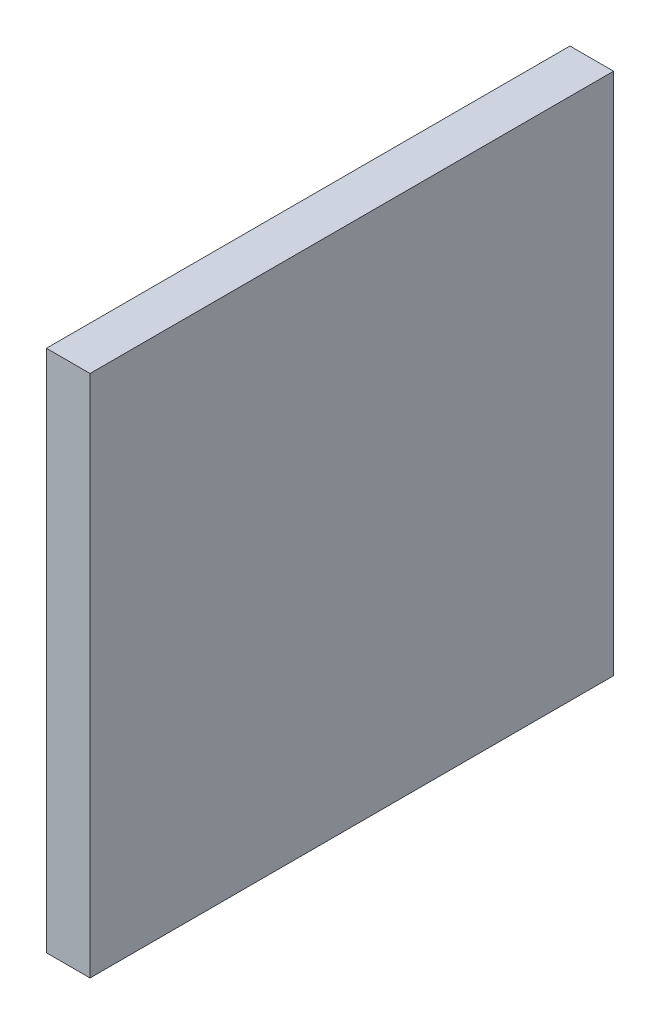
ISO-10303-21;
HEADER;
FILE_DESCRIPTION(('STEP AP214'),'2;1');
FILE_NAME('part.step','',(''),(''),'','','');
FILE_SCHEMA(('AUTOMOTIVE_DESIGN { 1 0 10303 214 1 1 1 1 }'));
ENDSEC;
DATA;
#1=APPLICATION_CONTEXT('core data for automotive mechanical design processes');
#2=APPLICATION_PROTOCOL_DEFINITION('international standard','automotive_design',2000,#1);
#3=PRODUCT_CONTEXT('',#1,'mechanical');
#4=PRODUCT('Part','Part','',(#3));
#5=PRODUCT_RELATED_PRODUCT_CATEGORY('part','',(#4));
#6=PRODUCT_DEFINITION_FORMATION('','',#4);
#7=PRODUCT_DEFINITION_CONTEXT('part definition',#1,'design');
#8=PRODUCT_DEFINITION('design','',#6,#7);
#9=PRODUCT_DEFINITION_SHAPE('','',#8);
#10=(LENGTH_UNIT() NAMED_UNIT(*) SI_UNIT(.MILLI.,.METRE.));
#11=(NAMED_UNIT(*) PLANE_ANGLE_UNIT() SI_UNIT($,.RADIAN.));
#12=(NAMED_UNIT(*) SI_UNIT($,.STERADIAN.) SOLID_ANGLE_UNIT());
#13=UNCERTAINTY_MEASURE_WITH_UNIT(LENGTH_MEASURE(1.E-05),#10,'distance_accuracy_value','');
#14=(GEOMETRIC_REPRESENTATION_CONTEXT(3) GLOBAL_UNCERTAINTY_ASSIGNED_CONTEXT((#13)) GLOBAL_UNIT_ASSIGNED_CONTEXT((#10,
#11,#12)) REPRESENTATION_CONTEXT('',''));
#15=CARTESIAN_POINT('',(0.,0.,0.));
#16=DIRECTION('',(0.,0.,1.));
#17=DIRECTION('',(1.,0.,0.));
#18=AXIS2_PLACEMENT_3D('',#15,#16,#17);
#19=CARTESIAN_POINT('',(0.,-457.2,190.5));
#20=DIRECTION('',(-1.,0.,0.));
#21=DIRECTION('',(0.,0.,1.));
#22=AXIS2_PLACEMENT_3D('',#19,#20,#21);
#23=PLANE('',#22);
#24=DIRECTION('',(0.,0.,1.));
#25=VECTOR('',#24,1.);
#26=CARTESIAN_POINT('',(0.,0.,190.5));
#27=LINE('',#26,#25);
#28=CARTESIAN_POINT('',(0.,0.,0.));
#29=VERTEX_POINT('',#28);
#30=CARTESIAN_POINT('',(0.,0.,457.2));
#31=VERTEX_POINT('',#30);
#32=EDGE_CURVE('E103',#29,#31,#27,.T.);
#33=ORIENTED_EDGE('',*,*,#32,.F.);
#34=DIRECTION('',(0.,1.,0.));
#35=VECTOR('',#34,1.);
#36=CARTESIAN_POINT('',(0.,-457.2,0.));
#37=LINE('',#36,#35);
#38=CARTESIAN_POINT('',(0.,-457.2,0.));
#39=VERTEX_POINT('',#38);
#40=EDGE_CURVE('E11',#39,#29,#37,.T.);
#41=ORIENTED_EDGE('',*,*,#40,.F.);
#42=DIRECTION('',(0.,0.,1.));
#43=VECTOR('',#42,1.);
#44=CARTESIAN_POINT('',(0.,-457.2,190.5));
#45=LINE('',#44,#43);
#46=CARTESIAN_POINT('',(0.,-457.2,457.2));
#47=VERTEX_POINT('',#46);
#48=EDGE_CURVE('E81',#39,#47,#45,.T.);
#49=ORIENTED_EDGE('',*,*,#48,.T.);
#50=DIRECTION('',(0.,1.,0.));
#51=VECTOR('',#50,1.);
#52=CARTESIAN_POINT('',(0.,-457.2,457.2));
#53=LINE('',#52,#51);
#54=EDGE_CURVE('E40',#47,#31,#53,.T.);
#55=ORIENTED_EDGE('',*,*,#54,.T.);
#56=EDGE_LOOP('',(#33,#41,#49,#55));
#57=FACE_BOUND('',#56,.T.);
#58=ADVANCED_FACE('F18',(#57),#23,.T.);
#59=CARTESIAN_POINT('',(51.7014593019343,-457.2,0.));
#60=DIRECTION('',(0.,0.,1.));
#61=DIRECTION('',(1.,0.,0.));
#62=AXIS2_PLACEMENT_3D('',#59,#60,#61);
#63=PLANE('',#62);
#64=DIRECTION('',(1.,0.,0.));
#65=VECTOR('',#64,1.);
#66=CARTESIAN_POINT('',(51.7014593019343,0.,0.));
#67=LINE('',#66,#65);
#68=CARTESIAN_POINT('',(38.1,0.,0.));
#69=VERTEX_POINT('',#68);
#70=EDGE_CURVE('E88',#29,#69,#67,.T.);
#71=ORIENTED_EDGE('',*,*,#70,.T.);
#72=DIRECTION('',(0.,1.,0.));
#73=VECTOR('',#72,1.);
#74=CARTESIAN_POINT('',(38.1,-457.2,0.));
#75=LINE('',#74,#73);
#76=CARTESIAN_POINT('',(38.1,-457.2,0.));
#77=VERTEX_POINT('',#76);
#78=EDGE_CURVE('E27',#77,#69,#75,.T.);
#79=ORIENTED_EDGE('',*,*,#78,.F.);
#80=DIRECTION('',(1.,0.,0.));
#81=VECTOR('',#80,1.);
#82=CARTESIAN_POINT('',(51.7014593019343,-457.2,0.));
#83=LINE('',#82,#81);
#84=EDGE_CURVE('E75',#39,#77,#83,.T.);
#85=ORIENTED_EDGE('',*,*,#84,.F.);
#86=ORIENTED_EDGE('',*,*,#40,.T.);
#87=EDGE_LOOP('',(#71,#79,#85,#86));
#88=FACE_BOUND('',#87,.T.);
#89=ADVANCED_FACE('F86',(#88),#63,.F.);
#90=CARTESIAN_POINT('',(38.1,-457.2,190.5));
#91=DIRECTION('',(-1.,0.,0.));
#92=DIRECTION('',(0.,0.,1.));
#93=AXIS2_PLACEMENT_3D('',#90,#91,#92);
#94=PLANE('',#93);
#95=DIRECTION('',(0.,0.,1.));
#96=VECTOR('',#95,1.);
#97=CARTESIAN_POINT('',(38.1,0.,190.5));
#98=LINE('',#97,#96);
#99=CARTESIAN_POINT('',(38.1,0.,457.2));
#100=VERTEX_POINT('',#99);
#101=EDGE_CURVE('E108',#69,#100,#98,.T.);
#102=ORIENTED_EDGE('',*,*,#101,.T.);
#103=DIRECTION('',(0.,1.,0.));
#104=VECTOR('',#103,1.);
#105=CARTESIAN_POINT('',(38.1,-457.2,457.2));
#106=LINE('',#105,#104);
#107=CARTESIAN_POINT('',(38.1,-457.2,457.2));
#108=VERTEX_POINT('',#107);
#109=EDGE_CURVE('E58',#108,#100,#106,.T.);
#110=ORIENTED_EDGE('',*,*,#109,.F.);
#111=DIRECTION('',(0.,0.,1.));
#112=VECTOR('',#111,1.);
#113=CARTESIAN_POINT('',(38.1,-457.2,190.5));
#114=LINE('',#113,#112);
#115=EDGE_CURVE('E80',#77,#108,#114,.T.);
#116=ORIENTED_EDGE('',*,*,#115,.F.);
#117=ORIENTED_EDGE('',*,*,#78,.T.);
#118=EDGE_LOOP('',(#102,#110,#116,#117));
#119=FACE_BOUND('',#118,.T.);
#120=ADVANCED_FACE('F92',(#119),#94,.F.);
#121=CARTESIAN_POINT('',(51.7014593019343,-457.2,457.2));
#122=DIRECTION('',(0.,0.,1.));
#123=DIRECTION('',(1.,0.,0.));
#124=AXIS2_PLACEMENT_3D('',#121,#122,#123);
#125=PLANE('',#124);
#126=DIRECTION('',(1.,0.,0.));
#127=VECTOR('',#126,1.);
#128=CARTESIAN_POINT('',(51.7014593019343,0.,457.2));
#129=LINE('',#128,#127);
#130=EDGE_CURVE('E110',#31,#100,#129,.T.);
#131=ORIENTED_EDGE('',*,*,#130,.F.);
#132=ORIENTED_EDGE('',*,*,#54,.F.);
#133=DIRECTION('',(1.,0.,0.));
#134=VECTOR('',#133,1.);
#135=CARTESIAN_POINT('',(51.7014593019343,-457.2,457.2));
#136=LINE('',#135,#134);
#137=EDGE_CURVE('E94',#47,#108,#136,.T.);
#138=ORIENTED_EDGE('',*,*,#137,.T.);
#139=ORIENTED_EDGE('',*,*,#109,.T.);
#140=EDGE_LOOP('',(#131,#132,#138,#139));
#141=FACE_BOUND('',#140,.T.);
#142=ADVANCED_FACE('F129',(#141),#125,.T.);
#143=CARTESIAN_POINT('',(19.05,-457.2,228.6));
#144=DIRECTION('',(0.,-1.,0.));
#145=DIRECTION('',(1.,0.,0.));
#146=AXIS2_PLACEMENT_3D('',#143,#144,#145);
#147=PLANE('',#146);
#148=ORIENTED_EDGE('',*,*,#48,.F.);
#149=ORIENTED_EDGE('',*,*,#84,.T.);
#150=ORIENTED_EDGE('',*,*,#115,.T.);
#151=ORIENTED_EDGE('',*,*,#137,.F.);
#152=EDGE_LOOP('',(#148,#149,#150,#151));
#153=FACE_BOUND('',#152,.T.);
#154=ADVANCED_FACE('F77',(#153),#147,.T.);
#155=CARTESIAN_POINT('',(19.05,0.,228.6));
#156=DIRECTION('',(0.,-1.,0.));
#157=DIRECTION('',(1.,0.,0.));
#158=AXIS2_PLACEMENT_3D('',#155,#156,#157);
#159=PLANE('',#158);
#160=ORIENTED_EDGE('',*,*,#32,.T.);
#161=ORIENTED_EDGE('',*,*,#130,.T.);
#162=ORIENTED_EDGE('',*,*,#101,.F.);
#163=ORIENTED_EDGE('',*,*,#70,.F.);
#164=EDGE_LOOP('',(#160,#161,#162,#163));
#165=FACE_BOUND('',#164,.T.);
#166=ADVANCED_FACE('F137',(#165),#159,.F.);
#167=CLOSED_SHELL('',(#58,#89,#120,#142,#154,#166));
#168=MANIFOLD_SOLID_BREP('B1',#167);
#169=ADVANCED_BREP_SHAPE_REPRESENTATION('',(#18,#168),#14);
#170=SHAPE_DEFINITION_REPRESENTATION(#9,#169);
ENDSEC;
END-ISO-10303-21;
